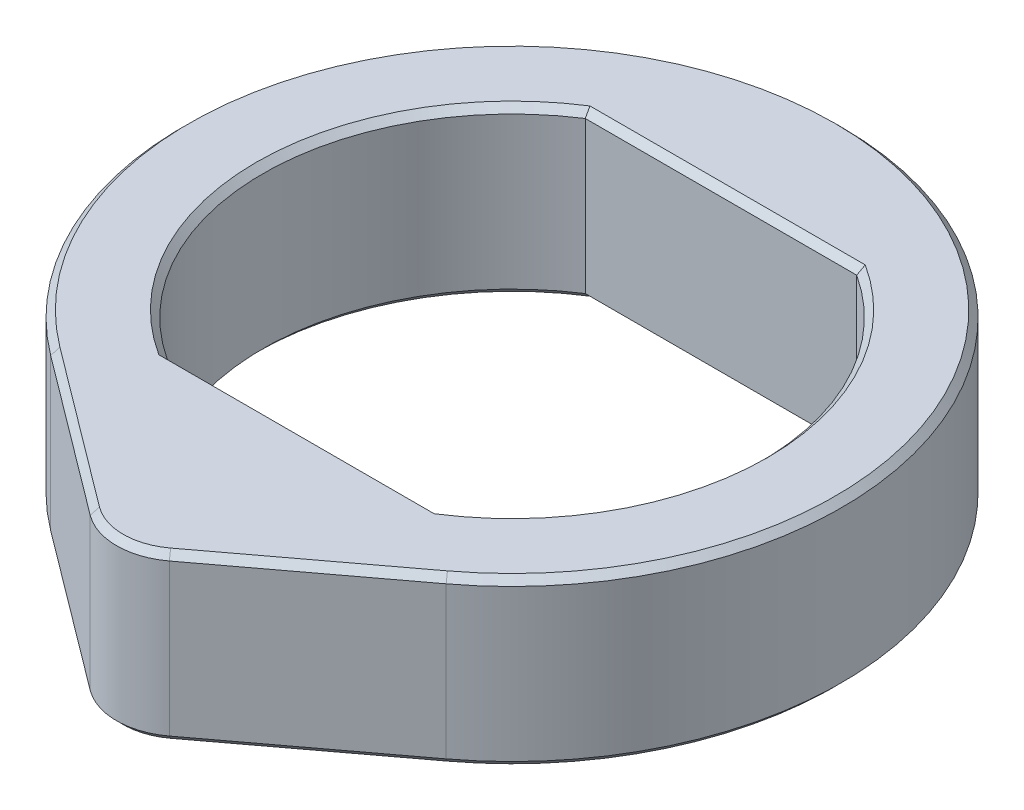
ISO-10303-21;
HEADER;
FILE_DESCRIPTION(('STEP AP214'),'2;1');
FILE_NAME('part.step','',(''),(''),'','','');
FILE_SCHEMA(('AUTOMOTIVE_DESIGN { 1 0 10303 214 1 1 1 1 }'));
ENDSEC;
DATA;
#1=APPLICATION_CONTEXT('core data for automotive mechanical design processes');
#2=APPLICATION_PROTOCOL_DEFINITION('international standard','automotive_design',2000,#1);
#3=PRODUCT_CONTEXT('',#1,'mechanical');
#4=PRODUCT('Part','Part','',(#3));
#5=PRODUCT_RELATED_PRODUCT_CATEGORY('part','',(#4));
#6=PRODUCT_DEFINITION_FORMATION('','',#4);
#7=PRODUCT_DEFINITION_CONTEXT('part definition',#1,'design');
#8=PRODUCT_DEFINITION('design','',#6,#7);
#9=PRODUCT_DEFINITION_SHAPE('','',#8);
#10=(LENGTH_UNIT() NAMED_UNIT(*) SI_UNIT(.MILLI.,.METRE.));
#11=(NAMED_UNIT(*) PLANE_ANGLE_UNIT() SI_UNIT($,.RADIAN.));
#12=(NAMED_UNIT(*) SI_UNIT($,.STERADIAN.) SOLID_ANGLE_UNIT());
#13=UNCERTAINTY_MEASURE_WITH_UNIT(LENGTH_MEASURE(1.E-05),#10,'distance_accuracy_value','');
#14=(GEOMETRIC_REPRESENTATION_CONTEXT(3) GLOBAL_UNCERTAINTY_ASSIGNED_CONTEXT((#13)) GLOBAL_UNIT_ASSIGNED_CONTEXT((#10,
#11,#12)) REPRESENTATION_CONTEXT('',''));
#15=CARTESIAN_POINT('',(0.,0.,0.));
#16=DIRECTION('',(0.,0.,1.));
#17=DIRECTION('',(1.,0.,0.));
#18=AXIS2_PLACEMENT_3D('',#15,#16,#17);
#19=CARTESIAN_POINT('',(0.,2.5,0.));
#20=DIRECTION('',(0.,-1.,0.));
#21=DIRECTION('',(0.,0.,-1.));
#22=AXIS2_PLACEMENT_3D('',#19,#20,#21);
#23=CYLINDRICAL_SURFACE('',#22,7.56);
#24=DIRECTION('',(0.,1.,0.));
#25=VECTOR('',#24,1.);
#26=CARTESIAN_POINT('',(4.11800922777014,-10.8258873400977,-6.34));
#27=LINE('',#26,#25);
#28=CARTESIAN_POINT('',(4.11800922777014,-2.3,-6.34));
#29=VERTEX_POINT('',#28);
#30=CARTESIAN_POINT('',(4.11800922777014,2.30000000000001,-6.34));
#31=VERTEX_POINT('',#30);
#32=EDGE_CURVE('E434',#29,#31,#27,.T.);
#33=ORIENTED_EDGE('',*,*,#32,.F.);
#34=CARTESIAN_POINT('',(0.,-2.3,0.));
#35=DIRECTION('',(0.,1.,0.));
#36=DIRECTION('',(0.,0.,1.));
#37=AXIS2_PLACEMENT_3D('',#34,#35,#36);
#38=CIRCLE('',#37,7.56);
#39=CARTESIAN_POINT('',(4.11800922777014,-2.3,6.34));
#40=VERTEX_POINT('',#39);
#41=EDGE_CURVE('E211',#29,#40,#38,.F.);
#42=ORIENTED_EDGE('',*,*,#41,.T.);
#43=DIRECTION('',(0.,1.,0.));
#44=VECTOR('',#43,1.);
#45=CARTESIAN_POINT('',(4.11800922777014,-10.8258873400977,6.34));
#46=LINE('',#45,#44);
#47=CARTESIAN_POINT('',(4.11800922777014,2.30000000000001,6.34));
#48=VERTEX_POINT('',#47);
#49=EDGE_CURVE('E428',#40,#48,#46,.T.);
#50=ORIENTED_EDGE('',*,*,#49,.T.);
#51=CARTESIAN_POINT('',(0.,2.30000000000001,0.));
#52=DIRECTION('',(0.,1.,0.));
#53=DIRECTION('',(0.,0.,1.));
#54=AXIS2_PLACEMENT_3D('',#51,#52,#53);
#55=CIRCLE('',#54,7.56);
#56=EDGE_CURVE('E209',#48,#31,#55,.T.);
#57=ORIENTED_EDGE('',*,*,#56,.T.);
#58=EDGE_LOOP('',(#33,#42,#50,#57));
#59=FACE_BOUND('',#58,.T.);
#60=ADVANCED_FACE('F41',(#59),#23,.F.);
#61=CARTESIAN_POINT('',(0.,2.5,0.));
#62=DIRECTION('',(0.,1.,0.));
#63=DIRECTION('',(0.,0.,1.));
#64=AXIS2_PLACEMENT_3D('',#61,#62,#63);
#65=PLANE('',#64);
#66=CARTESIAN_POINT('',(0.,2.5,0.));
#67=DIRECTION('',(0.,1.,0.));
#68=DIRECTION('',(0.,0.,1.));
#69=AXIS2_PLACEMENT_3D('',#66,#67,#68);
#70=CIRCLE('',#69,7.76);
#71=CARTESIAN_POINT('',(-4.17684091150237,2.5,6.54));
#72=VERTEX_POINT('',#71);
#73=CARTESIAN_POINT('',(-4.17684091150237,2.5,-6.54));
#74=VERTEX_POINT('',#73);
#75=EDGE_CURVE('E51',#72,#74,#70,.F.);
#76=ORIENTED_EDGE('',*,*,#75,.T.);
#77=DIRECTION('',(1.,0.,0.));
#78=VECTOR('',#77,1.);
#79=CARTESIAN_POINT('',(0.,2.5,-6.54));
#80=LINE('',#79,#78);
#81=CARTESIAN_POINT('',(4.17684091150237,2.5,-6.54));
#82=VERTEX_POINT('',#81);
#83=EDGE_CURVE('E11',#74,#82,#80,.T.);
#84=ORIENTED_EDGE('',*,*,#83,.T.);
#85=CARTESIAN_POINT('',(0.,2.5,0.));
#86=DIRECTION('',(0.,1.,0.));
#87=DIRECTION('',(0.,0.,1.));
#88=AXIS2_PLACEMENT_3D('',#85,#86,#87);
#89=CIRCLE('',#88,7.76);
#90=CARTESIAN_POINT('',(4.17684091150237,2.5,6.54));
#91=VERTEX_POINT('',#90);
#92=EDGE_CURVE('E238',#82,#91,#89,.F.);
#93=ORIENTED_EDGE('',*,*,#92,.T.);
#94=DIRECTION('',(-1.,0.,0.));
#95=VECTOR('',#94,1.);
#96=CARTESIAN_POINT('',(0.,2.5,6.54));
#97=LINE('',#96,#95);
#98=EDGE_CURVE('E62',#91,#72,#97,.T.);
#99=ORIENTED_EDGE('',*,*,#98,.T.);
#100=EDGE_LOOP('',(#76,#84,#93,#99));
#101=FACE_BOUND('',#100,.T.);
#102=CARTESIAN_POINT('',(0.,2.5,10.));
#103=DIRECTION('',(0.,1.,0.));
#104=DIRECTION('',(0.,0.,1.));
#105=AXIS2_PLACEMENT_3D('',#102,#103,#104);
#106=CIRCLE('',#105,1.8);
#107=CARTESIAN_POINT('',(-1.08,2.5,11.44));
#108=VERTEX_POINT('',#107);
#109=CARTESIAN_POINT('',(1.08,2.5,11.44));
#110=VERTEX_POINT('',#109);
#111=EDGE_CURVE('E233',#108,#110,#106,.T.);
#112=ORIENTED_EDGE('',*,*,#111,.T.);
#113=DIRECTION('',(0.8,0.,-0.6));
#114=VECTOR('',#113,1.);
#115=CARTESIAN_POINT('',(5.88,2.5,7.84));
#116=LINE('',#115,#114);
#117=CARTESIAN_POINT('',(5.88,2.5,7.84));
#118=VERTEX_POINT('',#117);
#119=EDGE_CURVE('E235',#110,#118,#116,.T.);
#120=ORIENTED_EDGE('',*,*,#119,.T.);
#121=CARTESIAN_POINT('',(0.,2.5,0.));
#122=DIRECTION('',(0.,1.,0.));
#123=DIRECTION('',(0.,0.,1.));
#124=AXIS2_PLACEMENT_3D('',#121,#122,#123);
#125=CIRCLE('',#124,9.8);
#126=CARTESIAN_POINT('',(-5.88,2.5,7.84));
#127=VERTEX_POINT('',#126);
#128=EDGE_CURVE('E229',#118,#127,#125,.T.);
#129=ORIENTED_EDGE('',*,*,#128,.T.);
#130=DIRECTION('',(0.8,0.,0.6));
#131=VECTOR('',#130,1.);
#132=CARTESIAN_POINT('',(-5.88,2.5,7.84));
#133=LINE('',#132,#131);
#134=EDGE_CURVE('E231',#127,#108,#133,.T.);
#135=ORIENTED_EDGE('',*,*,#134,.T.);
#136=EDGE_LOOP('',(#112,#120,#129,#135));
#137=FACE_BOUND('',#136,.T.);
#138=ADVANCED_FACE('F394',(#101,#137),#65,.T.);
#139=CARTESIAN_POINT('',(0.,-2.5,0.));
#140=DIRECTION('',(0.,1.,0.));
#141=DIRECTION('',(0.,0.,1.));
#142=AXIS2_PLACEMENT_3D('',#139,#140,#141);
#143=PLANE('',#142);
#144=CARTESIAN_POINT('',(0.,-2.5,0.));
#145=DIRECTION('',(0.,1.,0.));
#146=DIRECTION('',(0.,0.,1.));
#147=AXIS2_PLACEMENT_3D('',#144,#145,#146);
#148=CIRCLE('',#147,7.76);
#149=CARTESIAN_POINT('',(-4.17684091150238,-2.5,-6.54));
#150=VERTEX_POINT('',#149);
#151=CARTESIAN_POINT('',(-4.17684091150238,-2.5,6.54));
#152=VERTEX_POINT('',#151);
#153=EDGE_CURVE('E190',#150,#152,#148,.T.);
#154=ORIENTED_EDGE('',*,*,#153,.T.);
#155=DIRECTION('',(1.,0.,0.));
#156=VECTOR('',#155,1.);
#157=CARTESIAN_POINT('',(4.11800922777014,-2.5,6.54));
#158=LINE('',#157,#156);
#159=CARTESIAN_POINT('',(4.17684091150238,-2.5,6.54));
#160=VERTEX_POINT('',#159);
#161=EDGE_CURVE('E192',#152,#160,#158,.T.);
#162=ORIENTED_EDGE('',*,*,#161,.T.);
#163=CARTESIAN_POINT('',(0.,-2.5,0.));
#164=DIRECTION('',(0.,1.,0.));
#165=DIRECTION('',(0.,0.,1.));
#166=AXIS2_PLACEMENT_3D('',#163,#164,#165);
#167=CIRCLE('',#166,7.76);
#168=CARTESIAN_POINT('',(4.17684091150238,-2.5,-6.54));
#169=VERTEX_POINT('',#168);
#170=EDGE_CURVE('E182',#160,#169,#167,.T.);
#171=ORIENTED_EDGE('',*,*,#170,.T.);
#172=DIRECTION('',(-1.,0.,0.));
#173=VECTOR('',#172,1.);
#174=CARTESIAN_POINT('',(-4.11800922777014,-2.5,-6.54));
#175=LINE('',#174,#173);
#176=EDGE_CURVE('E184',#169,#150,#175,.T.);
#177=ORIENTED_EDGE('',*,*,#176,.T.);
#178=EDGE_LOOP('',(#154,#162,#171,#177));
#179=FACE_BOUND('',#178,.T.);
#180=CARTESIAN_POINT('',(0.,-2.5,10.));
#181=DIRECTION('',(0.,1.,0.));
#182=DIRECTION('',(0.,0.,1.));
#183=AXIS2_PLACEMENT_3D('',#180,#181,#182);
#184=CIRCLE('',#183,1.8);
#185=CARTESIAN_POINT('',(1.08,-2.5,11.44));
#186=VERTEX_POINT('',#185);
#187=CARTESIAN_POINT('',(-1.08,-2.5,11.44));
#188=VERTEX_POINT('',#187);
#189=EDGE_CURVE('E180',#186,#188,#184,.F.);
#190=ORIENTED_EDGE('',*,*,#189,.T.);
#191=DIRECTION('',(-0.8,0.,-0.6));
#192=VECTOR('',#191,1.);
#193=CARTESIAN_POINT('',(-5.88,-2.5,7.84));
#194=LINE('',#193,#192);
#195=CARTESIAN_POINT('',(-5.88,-2.5,7.84));
#196=VERTEX_POINT('',#195);
#197=EDGE_CURVE('E160',#188,#196,#194,.T.);
#198=ORIENTED_EDGE('',*,*,#197,.T.);
#199=CARTESIAN_POINT('',(0.,-2.5,0.));
#200=DIRECTION('',(0.,1.,0.));
#201=DIRECTION('',(0.,0.,1.));
#202=AXIS2_PLACEMENT_3D('',#199,#200,#201);
#203=CIRCLE('',#202,9.8);
#204=CARTESIAN_POINT('',(5.88,-2.5,7.84));
#205=VERTEX_POINT('',#204);
#206=EDGE_CURVE('E169',#196,#205,#203,.F.);
#207=ORIENTED_EDGE('',*,*,#206,.T.);
#208=DIRECTION('',(-0.8,0.,0.6));
#209=VECTOR('',#208,1.);
#210=CARTESIAN_POINT('',(1.08,-2.5,11.44));
#211=LINE('',#210,#209);
#212=EDGE_CURVE('E175',#205,#186,#211,.T.);
#213=ORIENTED_EDGE('',*,*,#212,.T.);
#214=EDGE_LOOP('',(#190,#198,#207,#213));
#215=FACE_BOUND('',#214,.T.);
#216=ADVANCED_FACE('F178',(#179,#215),#143,.F.);
#217=CARTESIAN_POINT('',(0.,2.5,0.));
#218=DIRECTION('',(0.,-1.,0.));
#219=DIRECTION('',(0.,0.,-1.));
#220=AXIS2_PLACEMENT_3D('',#217,#218,#219);
#221=CYLINDRICAL_SURFACE('',#220,10.);
#222=DIRECTION('',(0.,1.,0.));
#223=VECTOR('',#222,1.);
#224=CARTESIAN_POINT('',(6.,-15.1491106406735,8.));
#225=LINE('',#224,#223);
#226=CARTESIAN_POINT('',(6.,-2.3,8.));
#227=VERTEX_POINT('',#226);
#228=CARTESIAN_POINT('',(6.,2.3,8.));
#229=VERTEX_POINT('',#228);
#230=EDGE_CURVE('E436',#227,#229,#225,.T.);
#231=ORIENTED_EDGE('',*,*,#230,.F.);
#232=CARTESIAN_POINT('',(0.,-2.3,0.));
#233=DIRECTION('',(0.,1.,0.));
#234=DIRECTION('',(0.,0.,1.));
#235=AXIS2_PLACEMENT_3D('',#232,#233,#234);
#236=CIRCLE('',#235,10.);
#237=CARTESIAN_POINT('',(-6.,-2.3,8.));
#238=VERTEX_POINT('',#237);
#239=EDGE_CURVE('E227',#227,#238,#236,.T.);
#240=ORIENTED_EDGE('',*,*,#239,.T.);
#241=DIRECTION('',(0.,1.,0.));
#242=VECTOR('',#241,1.);
#243=CARTESIAN_POINT('',(-6.,-15.1491106406735,8.));
#244=LINE('',#243,#242);
#245=CARTESIAN_POINT('',(-6.,2.3,8.));
#246=VERTEX_POINT('',#245);
#247=EDGE_CURVE('E413',#238,#246,#244,.T.);
#248=ORIENTED_EDGE('',*,*,#247,.T.);
#249=CARTESIAN_POINT('',(0.,2.3,0.));
#250=DIRECTION('',(0.,1.,0.));
#251=DIRECTION('',(0.,0.,1.));
#252=AXIS2_PLACEMENT_3D('',#249,#250,#251);
#253=CIRCLE('',#252,10.);
#254=EDGE_CURVE('E225',#246,#229,#253,.F.);
#255=ORIENTED_EDGE('',*,*,#254,.T.);
#256=EDGE_LOOP('',(#231,#240,#248,#255));
#257=FACE_BOUND('',#256,.T.);
#258=ADVANCED_FACE('F418',(#257),#221,.T.);
#259=DIRECTION('',(0.,1.,0.));
#260=VECTOR('',#259,1.);
#261=CARTESIAN_POINT('',(-4.11800922777014,-10.8258873400977,6.34));
#262=LINE('',#261,#260);
#263=CARTESIAN_POINT('',(-4.11800922777014,-2.3,6.34));
#264=VERTEX_POINT('',#263);
#265=CARTESIAN_POINT('',(-4.11800922777014,2.30000000000001,6.34));
#266=VERTEX_POINT('',#265);
#267=EDGE_CURVE('E176',#264,#266,#262,.T.);
#268=ORIENTED_EDGE('',*,*,#267,.F.);
#269=CARTESIAN_POINT('',(0.,-2.3,0.));
#270=DIRECTION('',(0.,1.,0.));
#271=DIRECTION('',(0.,0.,1.));
#272=AXIS2_PLACEMENT_3D('',#269,#270,#271);
#273=CIRCLE('',#272,7.56);
#274=CARTESIAN_POINT('',(-4.11800922777014,-2.3,-6.34));
#275=VERTEX_POINT('',#274);
#276=EDGE_CURVE('E202',#264,#275,#273,.F.);
#277=ORIENTED_EDGE('',*,*,#276,.T.);
#278=DIRECTION('',(0.,1.,0.));
#279=VECTOR('',#278,1.);
#280=CARTESIAN_POINT('',(-4.11800922777014,-10.8258873400977,-6.34));
#281=LINE('',#280,#279);
#282=CARTESIAN_POINT('',(-4.11800922777014,2.30000000000001,-6.34));
#283=VERTEX_POINT('',#282);
#284=EDGE_CURVE('E431',#275,#283,#281,.T.);
#285=ORIENTED_EDGE('',*,*,#284,.T.);
#286=CARTESIAN_POINT('',(0.,2.30000000000001,0.));
#287=DIRECTION('',(0.,1.,0.));
#288=DIRECTION('',(0.,0.,1.));
#289=AXIS2_PLACEMENT_3D('',#286,#287,#288);
#290=CIRCLE('',#289,7.56);
#291=EDGE_CURVE('E200',#283,#266,#290,.T.);
#292=ORIENTED_EDGE('',*,*,#291,.T.);
#293=EDGE_LOOP('',(#268,#277,#285,#292));
#294=FACE_BOUND('',#293,.T.);
#295=ADVANCED_FACE('F464',(#294),#23,.F.);
#296=CARTESIAN_POINT('',(-4.11800922777014,-10.8258873400977,-6.34));
#297=DIRECTION('',(0.,0.,1.));
#298=DIRECTION('',(1.,0.,0.));
#299=AXIS2_PLACEMENT_3D('',#296,#297,#298);
#300=PLANE('',#299);
#301=ORIENTED_EDGE('',*,*,#284,.F.);
#302=DIRECTION('',(1.,0.,0.));
#303=VECTOR('',#302,1.);
#304=CARTESIAN_POINT('',(4.11800922777014,-2.3,-6.34));
#305=LINE('',#304,#303);
#306=EDGE_CURVE('E207',#275,#29,#305,.T.);
#307=ORIENTED_EDGE('',*,*,#306,.T.);
#308=ORIENTED_EDGE('',*,*,#32,.T.);
#309=DIRECTION('',(-1.,0.,0.));
#310=VECTOR('',#309,1.);
#311=CARTESIAN_POINT('',(-4.11800922777014,2.30000000000001,-6.34));
#312=LINE('',#311,#310);
#313=EDGE_CURVE('E204',#31,#283,#312,.T.);
#314=ORIENTED_EDGE('',*,*,#313,.T.);
#315=EDGE_LOOP('',(#301,#307,#308,#314));
#316=FACE_BOUND('',#315,.T.);
#317=ADVANCED_FACE('F458',(#316),#300,.T.);
#318=CARTESIAN_POINT('',(-4.11800922777014,-10.8258873400977,6.34));
#319=DIRECTION('',(0.,0.,-1.));
#320=DIRECTION('',(-1.,0.,0.));
#321=AXIS2_PLACEMENT_3D('',#318,#319,#320);
#322=PLANE('',#321);
#323=ORIENTED_EDGE('',*,*,#49,.F.);
#324=DIRECTION('',(-1.,0.,0.));
#325=VECTOR('',#324,1.);
#326=CARTESIAN_POINT('',(-4.11800922777014,-2.3,6.34));
#327=LINE('',#326,#325);
#328=EDGE_CURVE('E197',#40,#264,#327,.T.);
#329=ORIENTED_EDGE('',*,*,#328,.T.);
#330=ORIENTED_EDGE('',*,*,#267,.T.);
#331=DIRECTION('',(1.,0.,0.));
#332=VECTOR('',#331,1.);
#333=CARTESIAN_POINT('',(-4.11800922777014,2.30000000000001,6.34));
#334=LINE('',#333,#332);
#335=EDGE_CURVE('E195',#266,#48,#334,.T.);
#336=ORIENTED_EDGE('',*,*,#335,.T.);
#337=EDGE_LOOP('',(#323,#329,#330,#336));
#338=FACE_BOUND('',#337,.T.);
#339=ADVANCED_FACE('F451',(#338),#322,.T.);
#340=CARTESIAN_POINT('',(6.,-15.1491106406735,8.));
#341=DIRECTION('',(0.6,0.,0.8));
#342=DIRECTION('',(0.8,0.,-0.6));
#343=AXIS2_PLACEMENT_3D('',#340,#341,#342);
#344=PLANE('',#343);
#345=DIRECTION('',(0.,1.,0.));
#346=VECTOR('',#345,1.);
#347=CARTESIAN_POINT('',(1.2,-15.1491106406735,11.6));
#348=LINE('',#347,#346);
#349=CARTESIAN_POINT('',(1.2,-2.3,11.6));
#350=VERTEX_POINT('',#349);
#351=CARTESIAN_POINT('',(1.2,2.3,11.6));
#352=VERTEX_POINT('',#351);
#353=EDGE_CURVE('E421',#350,#352,#348,.T.);
#354=ORIENTED_EDGE('',*,*,#353,.F.);
#355=DIRECTION('',(0.8,0.,-0.6));
#356=VECTOR('',#355,1.);
#357=CARTESIAN_POINT('',(6.,-2.3,8.));
#358=LINE('',#357,#356);
#359=EDGE_CURVE('E223',#350,#227,#358,.T.);
#360=ORIENTED_EDGE('',*,*,#359,.T.);
#361=ORIENTED_EDGE('',*,*,#230,.T.);
#362=DIRECTION('',(-0.8,0.,0.6));
#363=VECTOR('',#362,1.);
#364=CARTESIAN_POINT('',(6.,2.3,8.));
#365=LINE('',#364,#363);
#366=EDGE_CURVE('E220',#229,#352,#365,.T.);
#367=ORIENTED_EDGE('',*,*,#366,.T.);
#368=EDGE_LOOP('',(#354,#360,#361,#367));
#369=FACE_BOUND('',#368,.T.);
#370=ADVANCED_FACE('F449',(#369),#344,.T.);
#371=CARTESIAN_POINT('',(0.,-15.1491106406735,10.));
#372=DIRECTION('',(0.,1.,0.));
#373=DIRECTION('',(0.,0.,1.));
#374=AXIS2_PLACEMENT_3D('',#371,#372,#373);
#375=CYLINDRICAL_SURFACE('',#374,2.);
#376=DIRECTION('',(0.,1.,0.));
#377=VECTOR('',#376,1.);
#378=CARTESIAN_POINT('',(-1.2,-15.1491106406735,11.6));
#379=LINE('',#378,#377);
#380=CARTESIAN_POINT('',(-1.2,-2.3,11.6));
#381=VERTEX_POINT('',#380);
#382=CARTESIAN_POINT('',(-1.2,2.3,11.6));
#383=VERTEX_POINT('',#382);
#384=EDGE_CURVE('E415',#381,#383,#379,.T.);
#385=ORIENTED_EDGE('',*,*,#384,.F.);
#386=CARTESIAN_POINT('',(0.,-2.3,10.));
#387=DIRECTION('',(0.,1.,0.));
#388=DIRECTION('',(0.,0.,1.));
#389=AXIS2_PLACEMENT_3D('',#386,#387,#388);
#390=CIRCLE('',#389,2.);
#391=EDGE_CURVE('E218',#381,#350,#390,.T.);
#392=ORIENTED_EDGE('',*,*,#391,.T.);
#393=ORIENTED_EDGE('',*,*,#353,.T.);
#394=CARTESIAN_POINT('',(0.,2.3,10.));
#395=DIRECTION('',(0.,1.,0.));
#396=DIRECTION('',(0.,0.,1.));
#397=AXIS2_PLACEMENT_3D('',#394,#395,#396);
#398=CIRCLE('',#397,2.);
#399=EDGE_CURVE('E216',#352,#383,#398,.F.);
#400=ORIENTED_EDGE('',*,*,#399,.T.);
#401=EDGE_LOOP('',(#385,#392,#393,#400));
#402=FACE_BOUND('',#401,.T.);
#403=ADVANCED_FACE('F446',(#402),#375,.T.);
#404=CARTESIAN_POINT('',(-6.,-15.1491106406735,8.));
#405=DIRECTION('',(-0.6,0.,0.8));
#406=DIRECTION('',(0.8,0.,0.6));
#407=AXIS2_PLACEMENT_3D('',#404,#405,#406);
#408=PLANE('',#407);
#409=ORIENTED_EDGE('',*,*,#247,.F.);
#410=DIRECTION('',(0.8,0.,0.6));
#411=VECTOR('',#410,1.);
#412=CARTESIAN_POINT('',(-1.2,-2.3,11.6));
#413=LINE('',#412,#411);
#414=EDGE_CURVE('E162',#238,#381,#413,.T.);
#415=ORIENTED_EDGE('',*,*,#414,.T.);
#416=ORIENTED_EDGE('',*,*,#384,.T.);
#417=DIRECTION('',(-0.8,0.,-0.6));
#418=VECTOR('',#417,1.);
#419=CARTESIAN_POINT('',(-6.,2.3,8.));
#420=LINE('',#419,#418);
#421=EDGE_CURVE('E213',#383,#246,#420,.T.);
#422=ORIENTED_EDGE('',*,*,#421,.T.);
#423=EDGE_LOOP('',(#409,#415,#416,#422));
#424=FACE_BOUND('',#423,.T.);
#425=ADVANCED_FACE('F293',(#424),#408,.T.);
#426=CARTESIAN_POINT('',(0.,-2.5,-6.54));
#427=DIRECTION('',(0.,-0.707106781186548,0.707106781186547));
#428=DIRECTION('',(1.,0.,0.));
#429=AXIS2_PLACEMENT_3D('',#426,#427,#428);
#430=PLANE('',#429);
#431=CARTESIAN_POINT('',(4.11800922777014,-2.3,-6.34));
#432=CARTESIAN_POINT('',(4.12788116879711,-2.33332352920064,-6.37332352920063));
#433=CARTESIAN_POINT('',(4.1377197796534,-2.36665196057642,-6.40665196057642));
#434=CARTESIAN_POINT('',(4.15733034089661,-2.43331862724322,-6.47331862724321));
#435=CARTESIAN_POINT('',(4.1671022912844,-2.4666568625341,-6.50665686253409));
#436=CARTESIAN_POINT('',(4.17684091150237,-2.5,-6.54));
#437=B_SPLINE_CURVE_WITH_KNOTS('',3,(#431,#432,#433,#434,#435,#436),.UNSPECIFIED.,.F.,.F.,(4,2,
4),(0.,0.144448269133628,0.288896536381853),.UNSPECIFIED.);
#438=EDGE_CURVE('E274',#29,#169,#437,.T.);
#439=ORIENTED_EDGE('',*,*,#438,.F.);
#440=ORIENTED_EDGE('',*,*,#306,.F.);
#441=CARTESIAN_POINT('',(-4.11800922777014,-2.3,-6.34));
#442=CARTESIAN_POINT('',(-4.12788116879711,-2.33332352920064,-6.37332352920063));
#443=CARTESIAN_POINT('',(-4.1377197796534,-2.36665196057642,-6.40665196057642));
#444=CARTESIAN_POINT('',(-4.15733034089661,-2.43331862724322,-6.47331862724321));
#445=CARTESIAN_POINT('',(-4.1671022912844,-2.4666568625341,-6.50665686253409));
#446=CARTESIAN_POINT('',(-4.17684091150237,-2.5,-6.54));
#447=B_SPLINE_CURVE_WITH_KNOTS('',3,(#441,#442,#443,#444,#445,#446),.UNSPECIFIED.,.F.,.F.,(4,2,
4),(0.,0.144448269133628,0.288896536381853),.UNSPECIFIED.);
#448=EDGE_CURVE('E281',#150,#275,#447,.F.);
#449=ORIENTED_EDGE('',*,*,#448,.F.);
#450=ORIENTED_EDGE('',*,*,#176,.F.);
#451=EDGE_LOOP('',(#439,#440,#449,#450));
#452=FACE_BOUND('',#451,.T.);
#453=ADVANCED_FACE('F287',(#452),#430,.T.);
#454=CARTESIAN_POINT('',(0.,-2.5,0.));
#455=DIRECTION('',(0.,-1.,0.));
#456=DIRECTION('',(0.,0.,-1.));
#457=AXIS2_PLACEMENT_3D('',#454,#455,#456);
#458=CONICAL_SURFACE('',#457,7.76,0.785398163397448);
#459=ORIENTED_EDGE('',*,*,#448,.T.);
#460=ORIENTED_EDGE('',*,*,#276,.F.);
#461=CARTESIAN_POINT('',(-4.11800922777014,-2.3,6.34));
#462=CARTESIAN_POINT('',(-4.12788116879711,-2.33332352920064,6.37332352920063));
#463=CARTESIAN_POINT('',(-4.1377197796534,-2.36665196057642,6.40665196057642));
#464=CARTESIAN_POINT('',(-4.15733034089661,-2.43331862724322,6.47331862724321));
#465=CARTESIAN_POINT('',(-4.1671022912844,-2.4666568625341,6.50665686253409));
#466=CARTESIAN_POINT('',(-4.17684091150237,-2.5,6.54));
#467=B_SPLINE_CURVE_WITH_KNOTS('',3,(#461,#462,#463,#464,#465,#466),.UNSPECIFIED.,.F.,.F.,(4,2,
4),(0.,0.144448269133628,0.288896536381853),.UNSPECIFIED.);
#468=EDGE_CURVE('E250',#152,#264,#467,.F.);
#469=ORIENTED_EDGE('',*,*,#468,.F.);
#470=ORIENTED_EDGE('',*,*,#153,.F.);
#471=EDGE_LOOP('',(#459,#460,#469,#470));
#472=FACE_BOUND('',#471,.T.);
#473=ADVANCED_FACE('F269',(#472),#458,.F.);
#474=CARTESIAN_POINT('',(0.,-2.5,0.));
#475=DIRECTION('',(0.,-1.,0.));
#476=DIRECTION('',(0.,0.,-1.));
#477=AXIS2_PLACEMENT_3D('',#474,#475,#476);
#478=CONICAL_SURFACE('',#477,7.76,0.785398163397448);
#479=ORIENTED_EDGE('',*,*,#438,.T.);
#480=ORIENTED_EDGE('',*,*,#170,.F.);
#481=CARTESIAN_POINT('',(4.17684091150238,-2.5,6.54));
#482=CARTESIAN_POINT('',(4.1671022912844,-2.4666568625341,6.50665686253409));
#483=CARTESIAN_POINT('',(4.15733034089661,-2.43331862724322,6.47331862724321));
#484=CARTESIAN_POINT('',(4.1377197796534,-2.36665196057642,6.40665196057642));
#485=CARTESIAN_POINT('',(4.12788116879711,-2.33332352920064,6.37332352920063));
#486=CARTESIAN_POINT('',(4.11800922777014,-2.3,6.34));
#487=B_SPLINE_CURVE_WITH_KNOTS('',3,(#481,#482,#483,#484,#485,#486),.UNSPECIFIED.,.F.,.F.,(4,2,
4),(0.,0.144448267248226,0.288896536381854),.UNSPECIFIED.);
#488=EDGE_CURVE('E242',#40,#160,#487,.F.);
#489=ORIENTED_EDGE('',*,*,#488,.F.);
#490=ORIENTED_EDGE('',*,*,#41,.F.);
#491=EDGE_LOOP('',(#479,#480,#489,#490));
#492=FACE_BOUND('',#491,.T.);
#493=ADVANCED_FACE('F263',(#492),#478,.F.);
#494=CARTESIAN_POINT('',(0.,-2.5,6.54));
#495=DIRECTION('',(0.,-0.707106781186548,-0.707106781186547));
#496=DIRECTION('',(-1.,0.,0.));
#497=AXIS2_PLACEMENT_3D('',#494,#495,#496);
#498=PLANE('',#497);
#499=ORIENTED_EDGE('',*,*,#468,.T.);
#500=ORIENTED_EDGE('',*,*,#328,.F.);
#501=ORIENTED_EDGE('',*,*,#488,.T.);
#502=ORIENTED_EDGE('',*,*,#161,.F.);
#503=EDGE_LOOP('',(#499,#500,#501,#502));
#504=FACE_BOUND('',#503,.T.);
#505=ADVANCED_FACE('F259',(#504),#498,.T.);
#506=CARTESIAN_POINT('',(5.88,-2.5,7.84));
#507=DIRECTION('',(0.424264068711928,-0.707106781186548,0.565685424949238));
#508=DIRECTION('',(0.8,0.,-0.6));
#509=AXIS2_PLACEMENT_3D('',#506,#507,#508);
#510=PLANE('',#509);
#511=DIRECTION('',(-0.424264068711931,-0.707106781186547,-0.565685424949237));
#512=VECTOR('',#511,1.);
#513=CARTESIAN_POINT('',(6.,-2.3,8.));
#514=LINE('',#513,#512);
#515=EDGE_CURVE('E172',#227,#205,#514,.T.);
#516=ORIENTED_EDGE('',*,*,#515,.F.);
#517=ORIENTED_EDGE('',*,*,#359,.F.);
#518=DIRECTION('',(0.42426406871193,0.707106781186548,0.565685424949237));
#519=VECTOR('',#518,1.);
#520=CARTESIAN_POINT('',(1.08,-2.5,11.44));
#521=LINE('',#520,#519);
#522=EDGE_CURVE('E251',#186,#350,#521,.T.);
#523=ORIENTED_EDGE('',*,*,#522,.F.);
#524=ORIENTED_EDGE('',*,*,#212,.F.);
#525=EDGE_LOOP('',(#516,#517,#523,#524));
#526=FACE_BOUND('',#525,.T.);
#527=ADVANCED_FACE('F315',(#526),#510,.T.);
#528=CARTESIAN_POINT('',(0.,-2.5,10.));
#529=DIRECTION('',(0.,1.,0.));
#530=DIRECTION('',(0.,0.,1.));
#531=AXIS2_PLACEMENT_3D('',#528,#529,#530);
#532=CONICAL_SURFACE('',#531,1.8,0.785398163397447);
#533=ORIENTED_EDGE('',*,*,#522,.T.);
#534=ORIENTED_EDGE('',*,*,#391,.F.);
#535=DIRECTION('',(-0.424264068711929,0.707106781186548,0.565685424949237));
#536=VECTOR('',#535,1.);
#537=CARTESIAN_POINT('',(-1.08,-2.5,11.44));
#538=LINE('',#537,#536);
#539=EDGE_CURVE('E165',#188,#381,#538,.T.);
#540=ORIENTED_EDGE('',*,*,#539,.F.);
#541=ORIENTED_EDGE('',*,*,#189,.F.);
#542=EDGE_LOOP('',(#533,#534,#540,#541));
#543=FACE_BOUND('',#542,.T.);
#544=ADVANCED_FACE('F309',(#543),#532,.T.);
#545=CARTESIAN_POINT('',(0.,-2.3,0.));
#546=DIRECTION('',(0.,1.,0.));
#547=DIRECTION('',(0.,0.,1.));
#548=AXIS2_PLACEMENT_3D('',#545,#546,#547);
#549=CONICAL_SURFACE('',#548,10.,0.785398163397448);
#550=ORIENTED_EDGE('',*,*,#515,.T.);
#551=ORIENTED_EDGE('',*,*,#206,.F.);
#552=DIRECTION('',(0.42426406871193,-0.707106781186548,-0.565685424949236));
#553=VECTOR('',#552,1.);
#554=CARTESIAN_POINT('',(-6.,-2.3,8.));
#555=LINE('',#554,#553);
#556=EDGE_CURVE('E156',#238,#196,#555,.T.);
#557=ORIENTED_EDGE('',*,*,#556,.F.);
#558=ORIENTED_EDGE('',*,*,#239,.F.);
#559=EDGE_LOOP('',(#550,#551,#557,#558));
#560=FACE_BOUND('',#559,.T.);
#561=ADVANCED_FACE('F170',(#560),#549,.T.);
#562=CARTESIAN_POINT('',(-5.88,-2.5,7.84));
#563=DIRECTION('',(-0.424264068711929,-0.707106781186546,0.565685424949239));
#564=DIRECTION('',(0.8,0.,0.6));
#565=AXIS2_PLACEMENT_3D('',#562,#563,#564);
#566=PLANE('',#565);
#567=ORIENTED_EDGE('',*,*,#539,.T.);
#568=ORIENTED_EDGE('',*,*,#414,.F.);
#569=ORIENTED_EDGE('',*,*,#556,.T.);
#570=ORIENTED_EDGE('',*,*,#197,.F.);
#571=EDGE_LOOP('',(#567,#568,#569,#570));
#572=FACE_BOUND('',#571,.T.);
#573=ADVANCED_FACE('F158',(#572),#566,.T.);
#574=CARTESIAN_POINT('',(0.,2.5,6.54));
#575=DIRECTION('',(0.,-0.707106781186548,0.707106781186547));
#576=DIRECTION('',(-1.,0.,0.));
#577=AXIS2_PLACEMENT_3D('',#574,#575,#576);
#578=PLANE('',#577);
#579=CARTESIAN_POINT('',(4.11800922777014,2.30000000000001,6.34));
#580=CARTESIAN_POINT('',(4.12788116879711,2.33332352920064,6.37332352920063));
#581=CARTESIAN_POINT('',(4.13771977965339,2.36665196057642,6.40665196057642));
#582=CARTESIAN_POINT('',(4.1573303408966,2.43331862724322,6.47331862724321));
#583=CARTESIAN_POINT('',(4.1671022912844,2.4666568625341,6.50665686253409));
#584=CARTESIAN_POINT('',(4.17684091150237,2.5,6.54));
#585=B_SPLINE_CURVE_WITH_KNOTS('',3,(#579,#580,#581,#582,#583,#584),.UNSPECIFIED.,.F.,.F.,(4,2,
4),(0.,0.144448269133627,0.288896536381851),.UNSPECIFIED.);
#586=EDGE_CURVE('E349',#48,#91,#585,.T.);
#587=ORIENTED_EDGE('',*,*,#586,.F.);
#588=ORIENTED_EDGE('',*,*,#335,.F.);
#589=CARTESIAN_POINT('',(-4.11800922777014,2.30000000000001,6.34));
#590=CARTESIAN_POINT('',(-4.12788116879711,2.33332352920064,6.37332352920063));
#591=CARTESIAN_POINT('',(-4.13771977965339,2.36665196057642,6.40665196057642));
#592=CARTESIAN_POINT('',(-4.1573303408966,2.43331862724322,6.47331862724321));
#593=CARTESIAN_POINT('',(-4.1671022912844,2.4666568625341,6.50665686253409));
#594=CARTESIAN_POINT('',(-4.17684091150237,2.5,6.54));
#595=B_SPLINE_CURVE_WITH_KNOTS('',3,(#589,#590,#591,#592,#593,#594),.UNSPECIFIED.,.F.,.F.,(4,2,
4),(0.,0.144448269133627,0.288896536381851),.UNSPECIFIED.);
#596=EDGE_CURVE('E166',#72,#266,#595,.F.);
#597=ORIENTED_EDGE('',*,*,#596,.F.);
#598=ORIENTED_EDGE('',*,*,#98,.F.);
#599=EDGE_LOOP('',(#587,#588,#597,#598));
#600=FACE_BOUND('',#599,.T.);
#601=ADVANCED_FACE('F303',(#600),#578,.F.);
#602=CARTESIAN_POINT('',(0.,2.30000000000001,0.));
#603=DIRECTION('',(0.,1.,0.));
#604=DIRECTION('',(0.,0.,1.));
#605=AXIS2_PLACEMENT_3D('',#602,#603,#604);
#606=CONICAL_SURFACE('',#605,7.56,0.78539816339745);
#607=ORIENTED_EDGE('',*,*,#596,.T.);
#608=ORIENTED_EDGE('',*,*,#291,.F.);
#609=CARTESIAN_POINT('',(-4.11800922777014,2.30000000000001,-6.34));
#610=CARTESIAN_POINT('',(-4.12788116879711,2.33332352920064,-6.37332352920063));
#611=CARTESIAN_POINT('',(-4.13771977965339,2.36665196057642,-6.40665196057642));
#612=CARTESIAN_POINT('',(-4.1573303408966,2.43331862724322,-6.47331862724321));
#613=CARTESIAN_POINT('',(-4.1671022912844,2.4666568625341,-6.50665686253409));
#614=CARTESIAN_POINT('',(-4.17684091150237,2.5,-6.54));
#615=B_SPLINE_CURVE_WITH_KNOTS('',3,(#609,#610,#611,#612,#613,#614),.UNSPECIFIED.,.F.,.F.,(4,2,
4),(0.,0.144448269133627,0.288896536381851),.UNSPECIFIED.);
#616=EDGE_CURVE('E343',#74,#283,#615,.F.);
#617=ORIENTED_EDGE('',*,*,#616,.F.);
#618=ORIENTED_EDGE('',*,*,#75,.F.);
#619=EDGE_LOOP('',(#607,#608,#617,#618));
#620=FACE_BOUND('',#619,.T.);
#621=ADVANCED_FACE('F357',(#620),#606,.F.);
#622=CARTESIAN_POINT('',(0.,2.30000000000001,0.));
#623=DIRECTION('',(0.,1.,0.));
#624=DIRECTION('',(0.,0.,1.));
#625=AXIS2_PLACEMENT_3D('',#622,#623,#624);
#626=CONICAL_SURFACE('',#625,7.56,0.78539816339745);
#627=ORIENTED_EDGE('',*,*,#586,.T.);
#628=ORIENTED_EDGE('',*,*,#92,.F.);
#629=CARTESIAN_POINT('',(4.17684091150237,2.5,-6.54));
#630=CARTESIAN_POINT('',(4.1671022912844,2.4666568625341,-6.50665686253409));
#631=CARTESIAN_POINT('',(4.1573303408966,2.43331862724322,-6.47331862724321));
#632=CARTESIAN_POINT('',(4.13771977965339,2.36665196057642,-6.40665196057642));
#633=CARTESIAN_POINT('',(4.12788116879711,2.33332352920064,-6.37332352920063));
#634=CARTESIAN_POINT('',(4.11800922777014,2.30000000000001,-6.34));
#635=B_SPLINE_CURVE_WITH_KNOTS('',3,(#629,#630,#631,#632,#633,#634),.UNSPECIFIED.,.F.,.F.,(4,2,
4),(0.,0.144448267248224,0.288896536381851),.UNSPECIFIED.);
#636=EDGE_CURVE('E336',#31,#82,#635,.F.);
#637=ORIENTED_EDGE('',*,*,#636,.F.);
#638=ORIENTED_EDGE('',*,*,#56,.F.);
#639=EDGE_LOOP('',(#627,#628,#637,#638));
#640=FACE_BOUND('',#639,.T.);
#641=ADVANCED_FACE('F330',(#640),#626,.F.);
#642=CARTESIAN_POINT('',(0.,2.5,-6.54));
#643=DIRECTION('',(0.,-0.707106781186548,-0.707106781186547));
#644=DIRECTION('',(1.,0.,0.));
#645=AXIS2_PLACEMENT_3D('',#642,#643,#644);
#646=PLANE('',#645);
#647=ORIENTED_EDGE('',*,*,#616,.T.);
#648=ORIENTED_EDGE('',*,*,#313,.F.);
#649=ORIENTED_EDGE('',*,*,#636,.T.);
#650=ORIENTED_EDGE('',*,*,#83,.F.);
#651=EDGE_LOOP('',(#647,#648,#649,#650));
#652=FACE_BOUND('',#651,.T.);
#653=ADVANCED_FACE('F323',(#652),#646,.F.);
#654=CARTESIAN_POINT('',(-5.88,2.5,7.84));
#655=DIRECTION('',(0.424264068711935,-0.707106781186537,-0.565685424949247));
#656=DIRECTION('',(0.8,0.,0.6));
#657=AXIS2_PLACEMENT_3D('',#654,#655,#656);
#658=PLANE('',#657);
#659=DIRECTION('',(0.424264068711925,0.707106781186556,-0.565685424949229));
#660=VECTOR('',#659,1.);
#661=CARTESIAN_POINT('',(-6.,2.3,8.));
#662=LINE('',#661,#660);
#663=EDGE_CURVE('E375',#246,#127,#662,.T.);
#664=ORIENTED_EDGE('',*,*,#663,.F.);
#665=ORIENTED_EDGE('',*,*,#421,.F.);
#666=DIRECTION('',(-0.424264068711923,-0.707106781186557,0.56568542494923));
#667=VECTOR('',#666,1.);
#668=CARTESIAN_POINT('',(-1.08,2.5,11.44));
#669=LINE('',#668,#667);
#670=EDGE_CURVE('E46',#108,#383,#669,.T.);
#671=ORIENTED_EDGE('',*,*,#670,.F.);
#672=ORIENTED_EDGE('',*,*,#134,.F.);
#673=EDGE_LOOP('',(#664,#665,#671,#672));
#674=FACE_BOUND('',#673,.T.);
#675=ADVANCED_FACE('F44',(#674),#658,.F.);
#676=CARTESIAN_POINT('',(0.,2.5,10.));
#677=DIRECTION('',(0.,-1.,0.));
#678=DIRECTION('',(0.,0.,-1.));
#679=AXIS2_PLACEMENT_3D('',#676,#677,#678);
#680=CONICAL_SURFACE('',#679,1.8,0.785398163397434);
#681=ORIENTED_EDGE('',*,*,#670,.T.);
#682=ORIENTED_EDGE('',*,*,#399,.F.);
#683=DIRECTION('',(0.424264068711923,-0.707106781186557,0.56568542494923));
#684=VECTOR('',#683,1.);
#685=CARTESIAN_POINT('',(1.08,2.5,11.44));
#686=LINE('',#685,#684);
#687=EDGE_CURVE('E374',#110,#352,#686,.T.);
#688=ORIENTED_EDGE('',*,*,#687,.F.);
#689=ORIENTED_EDGE('',*,*,#111,.F.);
#690=EDGE_LOOP('',(#681,#682,#688,#689));
#691=FACE_BOUND('',#690,.T.);
#692=ADVANCED_FACE('F401',(#691),#680,.T.);
#693=CARTESIAN_POINT('',(0.,2.5,0.));
#694=DIRECTION('',(0.,-1.,0.));
#695=DIRECTION('',(0.,0.,-1.));
#696=AXIS2_PLACEMENT_3D('',#693,#694,#695);
#697=CONICAL_SURFACE('',#696,9.8,0.78539816339744);
#698=ORIENTED_EDGE('',*,*,#663,.T.);
#699=ORIENTED_EDGE('',*,*,#128,.F.);
#700=DIRECTION('',(-0.424264068711926,0.707106781186554,-0.565685424949231));
#701=VECTOR('',#700,1.);
#702=CARTESIAN_POINT('',(6.,2.3,8.));
#703=LINE('',#702,#701);
#704=EDGE_CURVE('E372',#229,#118,#703,.T.);
#705=ORIENTED_EDGE('',*,*,#704,.F.);
#706=ORIENTED_EDGE('',*,*,#254,.F.);
#707=EDGE_LOOP('',(#698,#699,#705,#706));
#708=FACE_BOUND('',#707,.T.);
#709=ADVANCED_FACE('F406',(#708),#697,.T.);
#710=CARTESIAN_POINT('',(5.88,2.5,7.84));
#711=DIRECTION('',(-0.424264068711935,-0.707106781186537,-0.565685424949247));
#712=DIRECTION('',(0.8,0.,-0.6));
#713=AXIS2_PLACEMENT_3D('',#710,#711,#712);
#714=PLANE('',#713);
#715=ORIENTED_EDGE('',*,*,#687,.T.);
#716=ORIENTED_EDGE('',*,*,#366,.F.);
#717=ORIENTED_EDGE('',*,*,#704,.T.);
#718=ORIENTED_EDGE('',*,*,#119,.F.);
#719=EDGE_LOOP('',(#715,#716,#717,#718));
#720=FACE_BOUND('',#719,.T.);
#721=ADVANCED_FACE('F404',(#720),#714,.F.);
#722=CLOSED_SHELL('',(#60,#138,#216,#258,#295,#317,#339,#370,#403,#425,#453,#473,#493,#505,#527,
#544,#561,#573,#601,#621,#641,#653,#675,#692,#709,#721));
#723=MANIFOLD_SOLID_BREP('B2',#722);
#724=ADVANCED_BREP_SHAPE_REPRESENTATION('',(#18,#723),#14);
#725=SHAPE_DEFINITION_REPRESENTATION(#9,#724);
ENDSEC;
END-ISO-10303-21;
